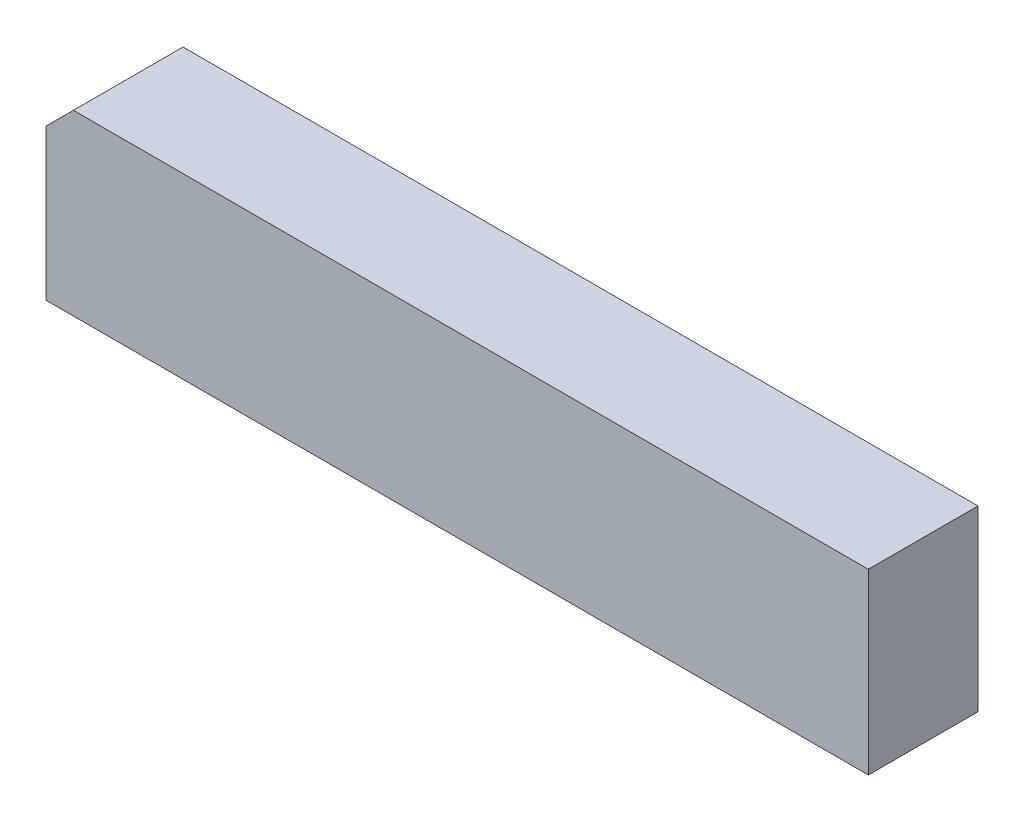
ISO-10303-21;
HEADER;
FILE_DESCRIPTION(('STEP AP214'),'2;1');
FILE_NAME('part.step','',(''),(''),'','','');
FILE_SCHEMA(('AUTOMOTIVE_DESIGN { 1 0 10303 214 1 1 1 1 }'));
ENDSEC;
DATA;
#1=APPLICATION_CONTEXT('core data for automotive mechanical design processes');
#2=APPLICATION_PROTOCOL_DEFINITION('international standard','automotive_design',2000,#1);
#3=PRODUCT_CONTEXT('',#1,'mechanical');
#4=PRODUCT('Part','Part','',(#3));
#5=PRODUCT_RELATED_PRODUCT_CATEGORY('part','',(#4));
#6=PRODUCT_DEFINITION_FORMATION('','',#4);
#7=PRODUCT_DEFINITION_CONTEXT('part definition',#1,'design');
#8=PRODUCT_DEFINITION('design','',#6,#7);
#9=PRODUCT_DEFINITION_SHAPE('','',#8);
#10=(LENGTH_UNIT() NAMED_UNIT(*) SI_UNIT(.MILLI.,.METRE.));
#11=(NAMED_UNIT(*) PLANE_ANGLE_UNIT() SI_UNIT($,.RADIAN.));
#12=(NAMED_UNIT(*) SI_UNIT($,.STERADIAN.) SOLID_ANGLE_UNIT());
#13=UNCERTAINTY_MEASURE_WITH_UNIT(LENGTH_MEASURE(1.E-05),#10,'distance_accuracy_value','');
#14=(GEOMETRIC_REPRESENTATION_CONTEXT(3) GLOBAL_UNCERTAINTY_ASSIGNED_CONTEXT((#13)) GLOBAL_UNIT_ASSIGNED_CONTEXT((#10,
#11,#12)) REPRESENTATION_CONTEXT('',''));
#15=CARTESIAN_POINT('',(0.,0.,0.));
#16=DIRECTION('',(0.,0.,1.));
#17=DIRECTION('',(1.,0.,0.));
#18=AXIS2_PLACEMENT_3D('',#15,#16,#17);
#19=CARTESIAN_POINT('',(0.,0.,4.));
#20=DIRECTION('',(1.,0.,0.));
#21=DIRECTION('',(0.,0.,-1.));
#22=AXIS2_PLACEMENT_3D('',#19,#20,#21);
#23=PLANE('',#22);
#24=DIRECTION('',(0.,-1.,0.));
#25=VECTOR('',#24,1.);
#26=CARTESIAN_POINT('',(0.,0.,0.));
#27=LINE('',#26,#25);
#28=CARTESIAN_POINT('',(0.,5.5,0.));
#29=VERTEX_POINT('',#28);
#30=CARTESIAN_POINT('',(0.,0.,0.));
#31=VERTEX_POINT('',#30);
#32=EDGE_CURVE('E107',#29,#31,#27,.T.);
#33=ORIENTED_EDGE('',*,*,#32,.T.);
#34=DIRECTION('',(0.,0.,-1.));
#35=VECTOR('',#34,1.);
#36=CARTESIAN_POINT('',(0.,0.,4.));
#37=LINE('',#36,#35);
#38=CARTESIAN_POINT('',(0.,0.,4.));
#39=VERTEX_POINT('',#38);
#40=EDGE_CURVE('E11',#39,#31,#37,.T.);
#41=ORIENTED_EDGE('',*,*,#40,.F.);
#42=DIRECTION('',(0.,-1.,0.));
#43=VECTOR('',#42,1.);
#44=CARTESIAN_POINT('',(0.,0.,4.));
#45=LINE('',#44,#43);
#46=CARTESIAN_POINT('',(0.,5.5,4.));
#47=VERTEX_POINT('',#46);
#48=EDGE_CURVE('E115',#47,#39,#45,.T.);
#49=ORIENTED_EDGE('',*,*,#48,.F.);
#50=DIRECTION('',(0.,0.,-1.));
#51=VECTOR('',#50,1.);
#52=CARTESIAN_POINT('',(0.,5.5,4.));
#53=LINE('',#52,#51);
#54=EDGE_CURVE('E103',#47,#29,#53,.T.);
#55=ORIENTED_EDGE('',*,*,#54,.T.);
#56=EDGE_LOOP('',(#33,#41,#49,#55));
#57=FACE_BOUND('',#56,.T.);
#58=ADVANCED_FACE('F33',(#57),#23,.F.);
#59=CARTESIAN_POINT('',(0.,0.,4.));
#60=DIRECTION('',(0.,1.,0.));
#61=DIRECTION('',(0.,0.,1.));
#62=AXIS2_PLACEMENT_3D('',#59,#60,#61);
#63=PLANE('',#62);
#64=DIRECTION('',(1.,0.,0.));
#65=VECTOR('',#64,1.);
#66=CARTESIAN_POINT('',(0.,0.,0.));
#67=LINE('',#66,#65);
#68=CARTESIAN_POINT('',(30.,0.,0.));
#69=VERTEX_POINT('',#68);
#70=EDGE_CURVE('E110',#31,#69,#67,.T.);
#71=ORIENTED_EDGE('',*,*,#70,.T.);
#72=DIRECTION('',(0.,0.,-1.));
#73=VECTOR('',#72,1.);
#74=CARTESIAN_POINT('',(30.,0.,4.));
#75=LINE('',#74,#73);
#76=CARTESIAN_POINT('',(30.,0.,4.));
#77=VERTEX_POINT('',#76);
#78=EDGE_CURVE('E41',#77,#69,#75,.T.);
#79=ORIENTED_EDGE('',*,*,#78,.F.);
#80=DIRECTION('',(1.,0.,0.));
#81=VECTOR('',#80,1.);
#82=CARTESIAN_POINT('',(0.,0.,4.));
#83=LINE('',#82,#81);
#84=EDGE_CURVE('E83',#39,#77,#83,.T.);
#85=ORIENTED_EDGE('',*,*,#84,.F.);
#86=ORIENTED_EDGE('',*,*,#40,.T.);
#87=EDGE_LOOP('',(#71,#79,#85,#86));
#88=FACE_BOUND('',#87,.T.);
#89=ADVANCED_FACE('F134',(#88),#63,.F.);
#90=CARTESIAN_POINT('',(30.,0.,4.));
#91=DIRECTION('',(-1.,0.,0.));
#92=DIRECTION('',(0.,0.,1.));
#93=AXIS2_PLACEMENT_3D('',#90,#91,#92);
#94=PLANE('',#93);
#95=DIRECTION('',(0.,1.,0.));
#96=VECTOR('',#95,1.);
#97=CARTESIAN_POINT('',(30.,0.,0.));
#98=LINE('',#97,#96);
#99=CARTESIAN_POINT('',(30.,6.5,0.));
#100=VERTEX_POINT('',#99);
#101=EDGE_CURVE('E98',#69,#100,#98,.T.);
#102=ORIENTED_EDGE('',*,*,#101,.T.);
#103=DIRECTION('',(0.,0.,-1.));
#104=VECTOR('',#103,1.);
#105=CARTESIAN_POINT('',(30.,6.5,4.));
#106=LINE('',#105,#104);
#107=CARTESIAN_POINT('',(30.,6.5,4.));
#108=VERTEX_POINT('',#107);
#109=EDGE_CURVE('E95',#108,#100,#106,.T.);
#110=ORIENTED_EDGE('',*,*,#109,.F.);
#111=DIRECTION('',(0.,1.,0.));
#112=VECTOR('',#111,1.);
#113=CARTESIAN_POINT('',(30.,0.,4.));
#114=LINE('',#113,#112);
#115=EDGE_CURVE('E87',#77,#108,#114,.T.);
#116=ORIENTED_EDGE('',*,*,#115,.F.);
#117=ORIENTED_EDGE('',*,*,#78,.T.);
#118=EDGE_LOOP('',(#102,#110,#116,#117));
#119=FACE_BOUND('',#118,.T.);
#120=ADVANCED_FACE('F96',(#119),#94,.F.);
#121=CARTESIAN_POINT('',(1.,6.5,4.));
#122=DIRECTION('',(0.,-1.,0.));
#123=DIRECTION('',(0.,0.,-1.));
#124=AXIS2_PLACEMENT_3D('',#121,#122,#123);
#125=PLANE('',#124);
#126=DIRECTION('',(-1.,0.,0.));
#127=VECTOR('',#126,1.);
#128=CARTESIAN_POINT('',(1.,6.5,0.));
#129=LINE('',#128,#127);
#130=CARTESIAN_POINT('',(1.,6.5,0.));
#131=VERTEX_POINT('',#130);
#132=EDGE_CURVE('E69',#100,#131,#129,.T.);
#133=ORIENTED_EDGE('',*,*,#132,.T.);
#134=DIRECTION('',(0.,0.,-1.));
#135=VECTOR('',#134,1.);
#136=CARTESIAN_POINT('',(1.,6.5,4.));
#137=LINE('',#136,#135);
#138=CARTESIAN_POINT('',(1.,6.5,4.));
#139=VERTEX_POINT('',#138);
#140=EDGE_CURVE('E99',#139,#131,#137,.T.);
#141=ORIENTED_EDGE('',*,*,#140,.F.);
#142=DIRECTION('',(-1.,0.,0.));
#143=VECTOR('',#142,1.);
#144=CARTESIAN_POINT('',(1.,6.5,4.));
#145=LINE('',#144,#143);
#146=EDGE_CURVE('E91',#108,#139,#145,.T.);
#147=ORIENTED_EDGE('',*,*,#146,.F.);
#148=ORIENTED_EDGE('',*,*,#109,.T.);
#149=EDGE_LOOP('',(#133,#141,#147,#148));
#150=FACE_BOUND('',#149,.T.);
#151=ADVANCED_FACE('F101',(#150),#125,.F.);
#152=CARTESIAN_POINT('',(0.,5.5,4.));
#153=DIRECTION('',(0.707106781186547,-0.707106781186547,0.));
#154=DIRECTION('',(0.707106781186548,0.707106781186548,0.));
#155=AXIS2_PLACEMENT_3D('',#152,#153,#154);
#156=PLANE('',#155);
#157=DIRECTION('',(-0.707106781186548,-0.707106781186548,0.));
#158=VECTOR('',#157,1.);
#159=CARTESIAN_POINT('',(0.,5.5,0.));
#160=LINE('',#159,#158);
#161=EDGE_CURVE('E75',#131,#29,#160,.T.);
#162=ORIENTED_EDGE('',*,*,#161,.T.);
#163=ORIENTED_EDGE('',*,*,#54,.F.);
#164=DIRECTION('',(-0.707106781186548,-0.707106781186548,0.));
#165=VECTOR('',#164,1.);
#166=CARTESIAN_POINT('',(0.,5.5,4.));
#167=LINE('',#166,#165);
#168=EDGE_CURVE('E49',#139,#47,#167,.T.);
#169=ORIENTED_EDGE('',*,*,#168,.F.);
#170=ORIENTED_EDGE('',*,*,#140,.T.);
#171=EDGE_LOOP('',(#162,#163,#169,#170));
#172=FACE_BOUND('',#171,.T.);
#173=ADVANCED_FACE('F123',(#172),#156,.F.);
#174=CARTESIAN_POINT('',(0.,0.,4.));
#175=DIRECTION('',(0.,0.,-1.));
#176=DIRECTION('',(-1.,0.,0.));
#177=AXIS2_PLACEMENT_3D('',#174,#175,#176);
#178=PLANE('',#177);
#179=ORIENTED_EDGE('',*,*,#48,.T.);
#180=ORIENTED_EDGE('',*,*,#84,.T.);
#181=ORIENTED_EDGE('',*,*,#115,.T.);
#182=ORIENTED_EDGE('',*,*,#146,.T.);
#183=ORIENTED_EDGE('',*,*,#168,.T.);
#184=EDGE_LOOP('',(#179,#180,#181,#182,#183));
#185=FACE_BOUND('',#184,.T.);
#186=ADVANCED_FACE('F89',(#185),#178,.F.);
#187=CARTESIAN_POINT('',(0.,0.,0.));
#188=DIRECTION('',(0.,0.,-1.));
#189=DIRECTION('',(-1.,0.,0.));
#190=AXIS2_PLACEMENT_3D('',#187,#188,#189);
#191=PLANE('',#190);
#192=ORIENTED_EDGE('',*,*,#32,.F.);
#193=ORIENTED_EDGE('',*,*,#161,.F.);
#194=ORIENTED_EDGE('',*,*,#132,.F.);
#195=ORIENTED_EDGE('',*,*,#101,.F.);
#196=ORIENTED_EDGE('',*,*,#70,.F.);
#197=EDGE_LOOP('',(#192,#193,#194,#195,#196));
#198=FACE_BOUND('',#197,.T.);
#199=ADVANCED_FACE('F119',(#198),#191,.T.);
#200=CLOSED_SHELL('',(#58,#89,#120,#151,#173,#186,#199));
#201=MANIFOLD_SOLID_BREP('B2',#200);
#202=ADVANCED_BREP_SHAPE_REPRESENTATION('',(#18,#201),#14);
#203=SHAPE_DEFINITION_REPRESENTATION(#9,#202);
ENDSEC;
END-ISO-10303-21;
